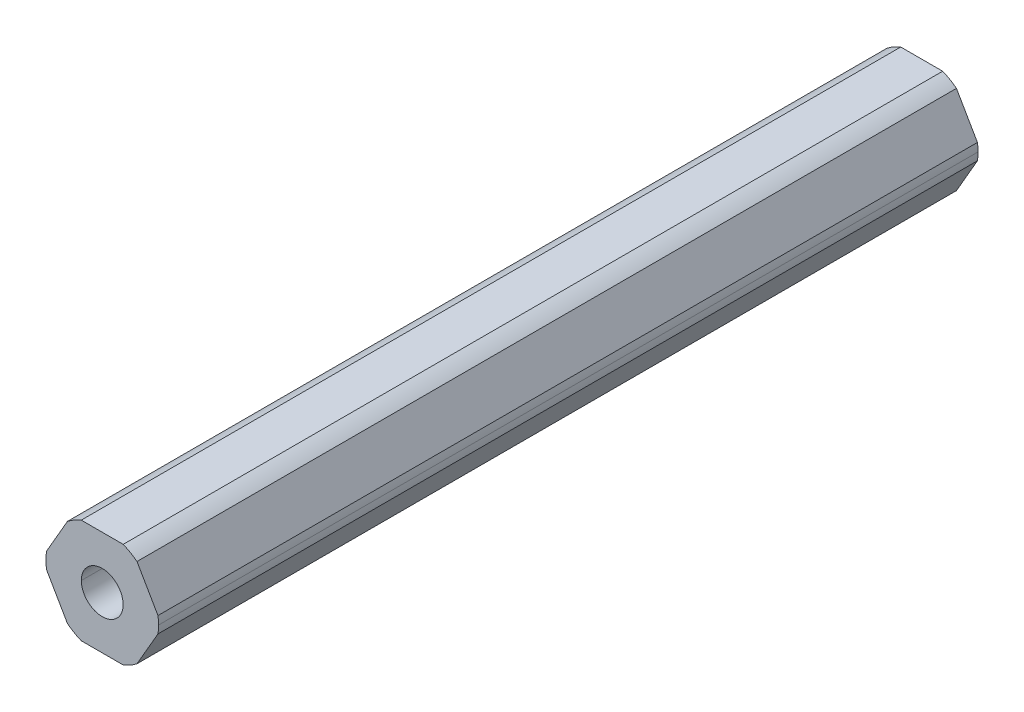
ISO-10303-21;
HEADER;
FILE_DESCRIPTION(('STEP AP214'),'2;1');
FILE_NAME('part.step','',(''),(''),'','','');
FILE_SCHEMA(('AUTOMOTIVE_DESIGN { 1 0 10303 214 1 1 1 1 }'));
ENDSEC;
DATA;
#1=APPLICATION_CONTEXT('core data for automotive mechanical design processes');
#2=APPLICATION_PROTOCOL_DEFINITION('international standard','automotive_design',2000,#1);
#3=PRODUCT_CONTEXT('',#1,'mechanical');
#4=PRODUCT('Part','Part','',(#3));
#5=PRODUCT_RELATED_PRODUCT_CATEGORY('part','',(#4));
#6=PRODUCT_DEFINITION_FORMATION('','',#4);
#7=PRODUCT_DEFINITION_CONTEXT('part definition',#1,'design');
#8=PRODUCT_DEFINITION('design','',#6,#7);
#9=PRODUCT_DEFINITION_SHAPE('','',#8);
#10=(LENGTH_UNIT() NAMED_UNIT(*) SI_UNIT(.MILLI.,.METRE.));
#11=(NAMED_UNIT(*) PLANE_ANGLE_UNIT() SI_UNIT($,.RADIAN.));
#12=(NAMED_UNIT(*) SI_UNIT($,.STERADIAN.) SOLID_ANGLE_UNIT());
#13=UNCERTAINTY_MEASURE_WITH_UNIT(LENGTH_MEASURE(1.E-05),#10,'distance_accuracy_value','');
#14=(GEOMETRIC_REPRESENTATION_CONTEXT(3) GLOBAL_UNCERTAINTY_ASSIGNED_CONTEXT((#13)) GLOBAL_UNIT_ASSIGNED_CONTEXT((#10,
#11,#12)) REPRESENTATION_CONTEXT('',''));
#15=CARTESIAN_POINT('',(0.,0.,0.));
#16=DIRECTION('',(0.,0.,1.));
#17=DIRECTION('',(1.,0.,0.));
#18=AXIS2_PLACEMENT_3D('',#15,#16,#17);
#19=CARTESIAN_POINT('',(0.,0.,-228.6));
#20=DIRECTION('',(0.,0.,1.));
#21=DIRECTION('',(1.,0.,0.));
#22=AXIS2_PLACEMENT_3D('',#19,#20,#21);
#23=CYLINDRICAL_SURFACE('',#22,2.55);
#24=CARTESIAN_POINT('',(0.,0.,-128.6));
#25=DIRECTION('',(0.,0.,1.));
#26=DIRECTION('',(1.,0.,0.));
#27=AXIS2_PLACEMENT_3D('',#24,#25,#26);
#28=CIRCLE('',#27,2.55);
#29=CARTESIAN_POINT('',(2.55,0.,-128.6));
#30=VERTEX_POINT('',#29);
#31=CARTESIAN_POINT('',(-2.55,0.,-128.6));
#32=VERTEX_POINT('',#31);
#33=EDGE_CURVE('E59',#30,#32,#28,.F.);
#34=ORIENTED_EDGE('',*,*,#33,.F.);
#35=DIRECTION('',(0.,0.,1.));
#36=VECTOR('',#35,1.);
#37=CARTESIAN_POINT('',(2.55,0.,-228.6));
#38=LINE('',#37,#36);
#39=CARTESIAN_POINT('',(2.55,0.,-228.6));
#40=VERTEX_POINT('',#39);
#41=EDGE_CURVE('E239',#40,#30,#38,.T.);
#42=ORIENTED_EDGE('',*,*,#41,.F.);
#43=CARTESIAN_POINT('',(0.,0.,-228.6));
#44=DIRECTION('',(0.,0.,1.));
#45=DIRECTION('',(1.,0.,0.));
#46=AXIS2_PLACEMENT_3D('',#43,#44,#45);
#47=CIRCLE('',#46,2.55);
#48=CARTESIAN_POINT('',(-2.55,0.,-228.6));
#49=VERTEX_POINT('',#48);
#50=EDGE_CURVE('E185',#49,#40,#47,.T.);
#51=ORIENTED_EDGE('',*,*,#50,.F.);
#52=DIRECTION('',(0.,0.,1.));
#53=VECTOR('',#52,1.);
#54=CARTESIAN_POINT('',(-2.55,0.,-228.6));
#55=LINE('',#54,#53);
#56=EDGE_CURVE('E46',#49,#32,#55,.T.);
#57=ORIENTED_EDGE('',*,*,#56,.T.);
#58=EDGE_LOOP('',(#34,#42,#51,#57));
#59=FACE_BOUND('',#58,.T.);
#60=ADVANCED_FACE('F38',(#59),#23,.F.);
#61=CARTESIAN_POINT('',(0.,0.,-228.6));
#62=DIRECTION('',(0.,0.,1.));
#63=DIRECTION('',(1.,0.,0.));
#64=AXIS2_PLACEMENT_3D('',#61,#62,#63);
#65=CYLINDRICAL_SURFACE('',#64,6.87);
#66=DIRECTION('',(0.,0.,1.));
#67=VECTOR('',#66,1.);
#68=CARTESIAN_POINT('',(6.87,0.,-228.6));
#69=LINE('',#68,#67);
#70=CARTESIAN_POINT('',(6.87,0.,-228.6));
#71=VERTEX_POINT('',#70);
#72=CARTESIAN_POINT('',(6.87,0.,-128.6));
#73=VERTEX_POINT('',#72);
#74=EDGE_CURVE('E237',#71,#73,#69,.T.);
#75=ORIENTED_EDGE('',*,*,#74,.T.);
#76=CARTESIAN_POINT('',(0.,0.,-128.6));
#77=DIRECTION('',(0.,0.,1.));
#78=DIRECTION('',(1.,0.,0.));
#79=AXIS2_PLACEMENT_3D('',#76,#77,#78);
#80=CIRCLE('',#79,6.87);
#81=CARTESIAN_POINT('',(6.80102150534208,-0.971085209378955,-128.6));
#82=VERTEX_POINT('',#81);
#83=EDGE_CURVE('E160',#82,#73,#80,.T.);
#84=ORIENTED_EDGE('',*,*,#83,.F.);
#85=DIRECTION('',(0.,0.,-1.));
#86=VECTOR('',#85,1.);
#87=CARTESIAN_POINT('',(6.80102150534208,-0.971085209378962,-228.6));
#88=LINE('',#87,#86);
#89=CARTESIAN_POINT('',(6.80102150534208,-0.971085209378955,-228.6));
#90=VERTEX_POINT('',#89);
#91=EDGE_CURVE('E235',#82,#90,#88,.T.);
#92=ORIENTED_EDGE('',*,*,#91,.T.);
#93=CARTESIAN_POINT('',(0.,0.,-228.6));
#94=DIRECTION('',(0.,0.,1.));
#95=DIRECTION('',(1.,0.,0.));
#96=AXIS2_PLACEMENT_3D('',#93,#94,#95);
#97=CIRCLE('',#96,6.87);
#98=EDGE_CURVE('E201',#90,#71,#97,.T.);
#99=ORIENTED_EDGE('',*,*,#98,.T.);
#100=EDGE_LOOP('',(#75,#84,#92,#99));
#101=FACE_BOUND('',#100,.T.);
#102=ADVANCED_FACE('F362',(#101),#65,.T.);
#103=CARTESIAN_POINT('',(3.68083890619154,-6.3754,228.6));
#104=DIRECTION('',(-0.866025403784439,0.5,0.));
#105=DIRECTION('',(0.,0.,1.));
#106=AXIS2_PLACEMENT_3D('',#103,#104,#105);
#107=PLANE('',#106);
#108=DIRECTION('',(0.500000000000001,0.866025403784438,0.));
#109=VECTOR('',#108,1.);
#110=CARTESIAN_POINT('',(4.24149521323254,-5.40431479062105,-128.6));
#111=LINE('',#110,#109);
#112=CARTESIAN_POINT('',(4.24149521323254,-5.40431479062105,-128.6));
#113=VERTEX_POINT('',#112);
#114=EDGE_CURVE('E305',#113,#82,#111,.T.);
#115=ORIENTED_EDGE('',*,*,#114,.F.);
#116=DIRECTION('',(0.,0.,1.));
#117=VECTOR('',#116,1.);
#118=CARTESIAN_POINT('',(4.24149521323255,-5.40431479062104,-228.6));
#119=LINE('',#118,#117);
#120=CARTESIAN_POINT('',(4.24149521323254,-5.40431479062105,-228.6));
#121=VERTEX_POINT('',#120);
#122=EDGE_CURVE('E179',#121,#113,#119,.T.);
#123=ORIENTED_EDGE('',*,*,#122,.F.);
#124=DIRECTION('',(0.5,0.866025403784439,0.));
#125=VECTOR('',#124,1.);
#126=CARTESIAN_POINT('',(3.68083890619154,-6.3754,-228.6));
#127=LINE('',#126,#125);
#128=EDGE_CURVE('E238',#121,#90,#127,.T.);
#129=ORIENTED_EDGE('',*,*,#128,.T.);
#130=ORIENTED_EDGE('',*,*,#91,.F.);
#131=EDGE_LOOP('',(#115,#123,#129,#130));
#132=FACE_BOUND('',#131,.T.);
#133=ADVANCED_FACE('F332',(#132),#107,.F.);
#134=CARTESIAN_POINT('',(7.36167781238308,0.,228.6));
#135=DIRECTION('',(-0.866025403784439,-0.5,0.));
#136=DIRECTION('',(-0.5,0.866025403784439,0.));
#137=AXIS2_PLACEMENT_3D('',#134,#135,#136);
#138=PLANE('',#137);
#139=DIRECTION('',(-0.5,0.866025403784438,0.));
#140=VECTOR('',#139,1.);
#141=CARTESIAN_POINT('',(6.80102150534208,0.97108520937895,-128.6));
#142=LINE('',#141,#140);
#143=CARTESIAN_POINT('',(6.80102150534208,0.97108520937895,-128.6));
#144=VERTEX_POINT('',#143);
#145=CARTESIAN_POINT('',(4.24149521323254,5.40431479062105,-128.6));
#146=VERTEX_POINT('',#145);
#147=EDGE_CURVE('E53',#144,#146,#142,.T.);
#148=ORIENTED_EDGE('',*,*,#147,.F.);
#149=DIRECTION('',(0.,0.,1.));
#150=VECTOR('',#149,1.);
#151=CARTESIAN_POINT('',(6.80102150534208,0.971085209378949,-228.6));
#152=LINE('',#151,#150);
#153=CARTESIAN_POINT('',(6.80102150534208,0.97108520937895,-228.6));
#154=VERTEX_POINT('',#153);
#155=EDGE_CURVE('E169',#154,#144,#152,.T.);
#156=ORIENTED_EDGE('',*,*,#155,.F.);
#157=DIRECTION('',(-0.5,0.866025403784439,0.));
#158=VECTOR('',#157,1.);
#159=CARTESIAN_POINT('',(7.36167781238308,0.,-228.6));
#160=LINE('',#159,#158);
#161=CARTESIAN_POINT('',(4.24149521323254,5.40431479062105,-228.6));
#162=VERTEX_POINT('',#161);
#163=EDGE_CURVE('E206',#154,#162,#160,.T.);
#164=ORIENTED_EDGE('',*,*,#163,.T.);
#165=DIRECTION('',(0.,0.,-1.));
#166=VECTOR('',#165,1.);
#167=CARTESIAN_POINT('',(4.24149521323254,5.40431479062105,-228.6));
#168=LINE('',#167,#166);
#169=EDGE_CURVE('E171',#146,#162,#168,.T.);
#170=ORIENTED_EDGE('',*,*,#169,.F.);
#171=EDGE_LOOP('',(#148,#156,#164,#170));
#172=FACE_BOUND('',#171,.T.);
#173=ADVANCED_FACE('F167',(#172),#138,.F.);
#174=CARTESIAN_POINT('',(3.68083890619154,6.3754,228.6));
#175=DIRECTION('',(0.,-1.,0.));
#176=DIRECTION('',(0.,0.,-1.));
#177=AXIS2_PLACEMENT_3D('',#174,#175,#176);
#178=PLANE('',#177);
#179=DIRECTION('',(-1.,0.,0.));
#180=VECTOR('',#179,1.);
#181=CARTESIAN_POINT('',(2.55952629210953,6.3754,-128.6));
#182=LINE('',#181,#180);
#183=CARTESIAN_POINT('',(2.55952629210953,6.3754,-128.6));
#184=VERTEX_POINT('',#183);
#185=CARTESIAN_POINT('',(-2.55952629210953,6.3754,-128.6));
#186=VERTEX_POINT('',#185);
#187=EDGE_CURVE('E319',#184,#186,#182,.T.);
#188=ORIENTED_EDGE('',*,*,#187,.F.);
#189=DIRECTION('',(0.,0.,1.));
#190=VECTOR('',#189,1.);
#191=CARTESIAN_POINT('',(2.55952629210952,6.3754,-228.6));
#192=LINE('',#191,#190);
#193=CARTESIAN_POINT('',(2.55952629210952,6.3754,-228.6));
#194=VERTEX_POINT('',#193);
#195=EDGE_CURVE('E243',#194,#184,#192,.T.);
#196=ORIENTED_EDGE('',*,*,#195,.F.);
#197=DIRECTION('',(-1.,0.,0.));
#198=VECTOR('',#197,1.);
#199=CARTESIAN_POINT('',(3.68083890619154,6.3754,-228.6));
#200=LINE('',#199,#198);
#201=CARTESIAN_POINT('',(-2.55952629210953,6.3754,-228.6));
#202=VERTEX_POINT('',#201);
#203=EDGE_CURVE('E202',#194,#202,#200,.T.);
#204=ORIENTED_EDGE('',*,*,#203,.T.);
#205=DIRECTION('',(0.,0.,-1.));
#206=VECTOR('',#205,1.);
#207=CARTESIAN_POINT('',(-2.55952629210953,6.3754,-228.6));
#208=LINE('',#207,#206);
#209=EDGE_CURVE('E230',#186,#202,#208,.T.);
#210=ORIENTED_EDGE('',*,*,#209,.F.);
#211=EDGE_LOOP('',(#188,#196,#204,#210));
#212=FACE_BOUND('',#211,.T.);
#213=ADVANCED_FACE('F323',(#212),#178,.F.);
#214=CARTESIAN_POINT('',(-3.68083890619154,6.3754,228.6));
#215=DIRECTION('',(0.866025403784439,-0.5,0.));
#216=DIRECTION('',(0.,0.,-1.));
#217=AXIS2_PLACEMENT_3D('',#214,#215,#216);
#218=PLANE('',#217);
#219=DIRECTION('',(-0.5,-0.866025403784438,0.));
#220=VECTOR('',#219,1.);
#221=CARTESIAN_POINT('',(-4.24149521323255,5.40431479062105,-128.6));
#222=LINE('',#221,#220);
#223=CARTESIAN_POINT('',(-4.24149521323254,5.40431479062105,-128.6));
#224=VERTEX_POINT('',#223);
#225=CARTESIAN_POINT('',(-6.80102150534208,0.97108520937896,-128.6));
#226=VERTEX_POINT('',#225);
#227=EDGE_CURVE('E290',#224,#226,#222,.T.);
#228=ORIENTED_EDGE('',*,*,#227,.F.);
#229=DIRECTION('',(0.,0.,1.));
#230=VECTOR('',#229,1.);
#231=CARTESIAN_POINT('',(-4.24149521323255,5.40431479062105,-228.6));
#232=LINE('',#231,#230);
#233=CARTESIAN_POINT('',(-4.24149521323255,5.40431479062105,-228.6));
#234=VERTEX_POINT('',#233);
#235=EDGE_CURVE('E257',#234,#224,#232,.T.);
#236=ORIENTED_EDGE('',*,*,#235,.F.);
#237=DIRECTION('',(-0.5,-0.866025403784439,0.));
#238=VECTOR('',#237,1.);
#239=CARTESIAN_POINT('',(-3.68083890619154,6.3754,-228.6));
#240=LINE('',#239,#238);
#241=CARTESIAN_POINT('',(-6.80102150534208,0.97108520937896,-228.6));
#242=VERTEX_POINT('',#241);
#243=EDGE_CURVE('E207',#234,#242,#240,.T.);
#244=ORIENTED_EDGE('',*,*,#243,.T.);
#245=DIRECTION('',(0.,0.,-1.));
#246=VECTOR('',#245,1.);
#247=CARTESIAN_POINT('',(-6.80102150534208,0.97108520937896,-228.6));
#248=LINE('',#247,#246);
#249=EDGE_CURVE('E208',#226,#242,#248,.T.);
#250=ORIENTED_EDGE('',*,*,#249,.F.);
#251=EDGE_LOOP('',(#228,#236,#244,#250));
#252=FACE_BOUND('',#251,.T.);
#253=ADVANCED_FACE('F287',(#252),#218,.F.);
#254=CARTESIAN_POINT('',(-7.36167781238308,0.,228.6));
#255=DIRECTION('',(0.866025403784439,0.5,0.));
#256=DIRECTION('',(0.,0.,-1.));
#257=AXIS2_PLACEMENT_3D('',#254,#255,#256);
#258=PLANE('',#257);
#259=DIRECTION('',(0.5,-0.866025403784439,0.));
#260=VECTOR('',#259,1.);
#261=CARTESIAN_POINT('',(-6.80102150534208,-0.971085209378954,-128.6));
#262=LINE('',#261,#260);
#263=CARTESIAN_POINT('',(-6.80102150534208,-0.971085209378951,-128.6));
#264=VERTEX_POINT('',#263);
#265=CARTESIAN_POINT('',(-4.24149521323254,-5.40431479062105,-128.6));
#266=VERTEX_POINT('',#265);
#267=EDGE_CURVE('E313',#264,#266,#262,.T.);
#268=ORIENTED_EDGE('',*,*,#267,.F.);
#269=DIRECTION('',(0.,0.,1.));
#270=VECTOR('',#269,1.);
#271=CARTESIAN_POINT('',(-6.80102150534208,-0.971085209378962,-228.6));
#272=LINE('',#271,#270);
#273=CARTESIAN_POINT('',(-6.80102150534208,-0.971085209378956,-228.6));
#274=VERTEX_POINT('',#273);
#275=EDGE_CURVE('E226',#274,#264,#272,.T.);
#276=ORIENTED_EDGE('',*,*,#275,.F.);
#277=DIRECTION('',(0.5,-0.866025403784439,0.));
#278=VECTOR('',#277,1.);
#279=CARTESIAN_POINT('',(-7.36167781238308,0.,-228.6));
#280=LINE('',#279,#278);
#281=CARTESIAN_POINT('',(-4.24149521323254,-5.40431479062105,-228.6));
#282=VERTEX_POINT('',#281);
#283=EDGE_CURVE('E221',#274,#282,#280,.T.);
#284=ORIENTED_EDGE('',*,*,#283,.T.);
#285=DIRECTION('',(0.,0.,-1.));
#286=VECTOR('',#285,1.);
#287=CARTESIAN_POINT('',(-4.24149521323255,-5.40431479062104,-228.6));
#288=LINE('',#287,#286);
#289=EDGE_CURVE('E216',#266,#282,#288,.T.);
#290=ORIENTED_EDGE('',*,*,#289,.F.);
#291=EDGE_LOOP('',(#268,#276,#284,#290));
#292=FACE_BOUND('',#291,.T.);
#293=ADVANCED_FACE('F346',(#292),#258,.F.);
#294=CARTESIAN_POINT('',(-3.68083890619154,-6.3754,228.6));
#295=DIRECTION('',(0.,1.,0.));
#296=DIRECTION('',(1.,0.,0.));
#297=AXIS2_PLACEMENT_3D('',#294,#295,#296);
#298=PLANE('',#297);
#299=DIRECTION('',(1.,0.,0.));
#300=VECTOR('',#299,1.);
#301=CARTESIAN_POINT('',(-2.55952629210953,-6.3754,-128.6));
#302=LINE('',#301,#300);
#303=CARTESIAN_POINT('',(-2.55952629210953,-6.3754,-128.6));
#304=VERTEX_POINT('',#303);
#305=CARTESIAN_POINT('',(2.55952629210953,-6.3754,-128.6));
#306=VERTEX_POINT('',#305);
#307=EDGE_CURVE('E309',#304,#306,#302,.T.);
#308=ORIENTED_EDGE('',*,*,#307,.F.);
#309=DIRECTION('',(0.,0.,1.));
#310=VECTOR('',#309,1.);
#311=CARTESIAN_POINT('',(-2.55952629210953,-6.3754,-228.6));
#312=LINE('',#311,#310);
#313=CARTESIAN_POINT('',(-2.55952629210953,-6.3754,-228.6));
#314=VERTEX_POINT('',#313);
#315=EDGE_CURVE('E209',#314,#304,#312,.T.);
#316=ORIENTED_EDGE('',*,*,#315,.F.);
#317=DIRECTION('',(1.,0.,0.));
#318=VECTOR('',#317,1.);
#319=CARTESIAN_POINT('',(-3.68083890619154,-6.3754,-228.6));
#320=LINE('',#319,#318);
#321=CARTESIAN_POINT('',(2.55952629210953,-6.3754,-228.6));
#322=VERTEX_POINT('',#321);
#323=EDGE_CURVE('E217',#314,#322,#320,.T.);
#324=ORIENTED_EDGE('',*,*,#323,.T.);
#325=DIRECTION('',(0.,0.,-1.));
#326=VECTOR('',#325,1.);
#327=CARTESIAN_POINT('',(2.55952629210953,-6.3754,-228.6));
#328=LINE('',#327,#326);
#329=EDGE_CURVE('E189',#306,#322,#328,.T.);
#330=ORIENTED_EDGE('',*,*,#329,.F.);
#331=EDGE_LOOP('',(#308,#316,#324,#330));
#332=FACE_BOUND('',#331,.T.);
#333=ADVANCED_FACE('F350',(#332),#298,.F.);
#334=CARTESIAN_POINT('',(0.,0.,-228.6));
#335=DIRECTION('',(0.,0.,1.));
#336=DIRECTION('',(1.,0.,0.));
#337=AXIS2_PLACEMENT_3D('',#334,#335,#336);
#338=CYLINDRICAL_SURFACE('',#337,6.87);
#339=ORIENTED_EDGE('',*,*,#155,.T.);
#340=EDGE_CURVE('E157',#73,#144,#80,.T.);
#341=ORIENTED_EDGE('',*,*,#340,.F.);
#342=ORIENTED_EDGE('',*,*,#74,.F.);
#343=CARTESIAN_POINT('',(0.,0.,-228.6));
#344=DIRECTION('',(0.,0.,1.));
#345=DIRECTION('',(1.,0.,0.));
#346=AXIS2_PLACEMENT_3D('',#343,#344,#345);
#347=CIRCLE('',#346,6.87);
#348=EDGE_CURVE('E177',#71,#154,#347,.T.);
#349=ORIENTED_EDGE('',*,*,#348,.T.);
#350=EDGE_LOOP('',(#339,#341,#342,#349));
#351=FACE_BOUND('',#350,.T.);
#352=ADVANCED_FACE('F175',(#351),#338,.T.);
#353=CARTESIAN_POINT('',(0.,0.,-228.6));
#354=DIRECTION('',(0.,0.,1.));
#355=DIRECTION('',(1.,0.,0.));
#356=AXIS2_PLACEMENT_3D('',#353,#354,#355);
#357=CYLINDRICAL_SURFACE('',#356,6.87);
#358=ORIENTED_EDGE('',*,*,#122,.T.);
#359=CARTESIAN_POINT('',(0.,0.,-128.6));
#360=DIRECTION('',(0.,0.,1.));
#361=DIRECTION('',(1.,0.,0.));
#362=AXIS2_PLACEMENT_3D('',#359,#360,#361);
#363=CIRCLE('',#362,6.87);
#364=EDGE_CURVE('E307',#306,#113,#363,.T.);
#365=ORIENTED_EDGE('',*,*,#364,.F.);
#366=ORIENTED_EDGE('',*,*,#329,.T.);
#367=CARTESIAN_POINT('',(0.,0.,-228.6));
#368=DIRECTION('',(0.,0.,1.));
#369=DIRECTION('',(1.,0.,0.));
#370=AXIS2_PLACEMENT_3D('',#367,#368,#369);
#371=CIRCLE('',#370,6.87);
#372=EDGE_CURVE('E193',#322,#121,#371,.T.);
#373=ORIENTED_EDGE('',*,*,#372,.T.);
#374=EDGE_LOOP('',(#358,#365,#366,#373));
#375=FACE_BOUND('',#374,.T.);
#376=ADVANCED_FACE('F335',(#375),#357,.T.);
#377=CARTESIAN_POINT('',(0.,0.,-228.6));
#378=DIRECTION('',(0.,0.,1.));
#379=DIRECTION('',(1.,0.,0.));
#380=AXIS2_PLACEMENT_3D('',#377,#378,#379);
#381=CYLINDRICAL_SURFACE('',#380,6.87);
#382=ORIENTED_EDGE('',*,*,#315,.T.);
#383=CARTESIAN_POINT('',(0.,0.,-128.6));
#384=DIRECTION('',(0.,0.,1.));
#385=DIRECTION('',(1.,0.,0.));
#386=AXIS2_PLACEMENT_3D('',#383,#384,#385);
#387=CIRCLE('',#386,6.87);
#388=EDGE_CURVE('E311',#266,#304,#387,.T.);
#389=ORIENTED_EDGE('',*,*,#388,.F.);
#390=ORIENTED_EDGE('',*,*,#289,.T.);
#391=CARTESIAN_POINT('',(0.,0.,-228.6));
#392=DIRECTION('',(0.,0.,1.));
#393=DIRECTION('',(1.,0.,0.));
#394=AXIS2_PLACEMENT_3D('',#391,#392,#393);
#395=CIRCLE('',#394,6.87);
#396=EDGE_CURVE('E212',#282,#314,#395,.T.);
#397=ORIENTED_EDGE('',*,*,#396,.T.);
#398=EDGE_LOOP('',(#382,#389,#390,#397));
#399=FACE_BOUND('',#398,.T.);
#400=ADVANCED_FACE('F341',(#399),#381,.T.);
#401=CARTESIAN_POINT('',(0.,0.,-228.6));
#402=DIRECTION('',(0.,0.,1.));
#403=DIRECTION('',(1.,0.,0.));
#404=AXIS2_PLACEMENT_3D('',#401,#402,#403);
#405=CYLINDRICAL_SURFACE('',#404,6.87);
#406=ORIENTED_EDGE('',*,*,#275,.T.);
#407=CARTESIAN_POINT('',(0.,0.,-128.6));
#408=DIRECTION('',(0.,0.,1.));
#409=DIRECTION('',(1.,0.,0.));
#410=AXIS2_PLACEMENT_3D('',#407,#408,#409);
#411=CIRCLE('',#410,6.87);
#412=EDGE_CURVE('E315',#226,#264,#411,.T.);
#413=ORIENTED_EDGE('',*,*,#412,.F.);
#414=ORIENTED_EDGE('',*,*,#249,.T.);
#415=CARTESIAN_POINT('',(0.,0.,-228.6));
#416=DIRECTION('',(0.,0.,1.));
#417=DIRECTION('',(1.,0.,0.));
#418=AXIS2_PLACEMENT_3D('',#415,#416,#417);
#419=CIRCLE('',#418,6.87);
#420=EDGE_CURVE('E210',#242,#274,#419,.T.);
#421=ORIENTED_EDGE('',*,*,#420,.T.);
#422=EDGE_LOOP('',(#406,#413,#414,#421));
#423=FACE_BOUND('',#422,.T.);
#424=ADVANCED_FACE('F348',(#423),#405,.T.);
#425=CARTESIAN_POINT('',(0.,0.,-228.6));
#426=DIRECTION('',(0.,0.,1.));
#427=DIRECTION('',(1.,0.,0.));
#428=AXIS2_PLACEMENT_3D('',#425,#426,#427);
#429=CYLINDRICAL_SURFACE('',#428,6.87);
#430=ORIENTED_EDGE('',*,*,#235,.T.);
#431=CARTESIAN_POINT('',(0.,0.,-128.6));
#432=DIRECTION('',(0.,0.,1.));
#433=DIRECTION('',(1.,0.,0.));
#434=AXIS2_PLACEMENT_3D('',#431,#432,#433);
#435=CIRCLE('',#434,6.87);
#436=EDGE_CURVE('E281',#186,#224,#435,.T.);
#437=ORIENTED_EDGE('',*,*,#436,.F.);
#438=ORIENTED_EDGE('',*,*,#209,.T.);
#439=CARTESIAN_POINT('',(0.,0.,-228.6));
#440=DIRECTION('',(0.,0.,1.));
#441=DIRECTION('',(1.,0.,0.));
#442=AXIS2_PLACEMENT_3D('',#439,#440,#441);
#443=CIRCLE('',#442,6.87);
#444=EDGE_CURVE('E253',#202,#234,#443,.T.);
#445=ORIENTED_EDGE('',*,*,#444,.T.);
#446=EDGE_LOOP('',(#430,#437,#438,#445));
#447=FACE_BOUND('',#446,.T.);
#448=ADVANCED_FACE('F280',(#447),#429,.T.);
#449=CARTESIAN_POINT('',(0.,0.,-228.6));
#450=DIRECTION('',(0.,0.,1.));
#451=DIRECTION('',(1.,0.,0.));
#452=AXIS2_PLACEMENT_3D('',#449,#450,#451);
#453=CYLINDRICAL_SURFACE('',#452,6.87);
#454=ORIENTED_EDGE('',*,*,#195,.T.);
#455=CARTESIAN_POINT('',(0.,0.,-128.6));
#456=DIRECTION('',(0.,0.,1.));
#457=DIRECTION('',(1.,0.,0.));
#458=AXIS2_PLACEMENT_3D('',#455,#456,#457);
#459=CIRCLE('',#458,6.87);
#460=EDGE_CURVE('E172',#146,#184,#459,.T.);
#461=ORIENTED_EDGE('',*,*,#460,.F.);
#462=ORIENTED_EDGE('',*,*,#169,.T.);
#463=CARTESIAN_POINT('',(0.,0.,-228.6));
#464=DIRECTION('',(0.,0.,1.));
#465=DIRECTION('',(1.,0.,0.));
#466=AXIS2_PLACEMENT_3D('',#463,#464,#465);
#467=CIRCLE('',#466,6.87);
#468=EDGE_CURVE('E259',#162,#194,#467,.T.);
#469=ORIENTED_EDGE('',*,*,#468,.T.);
#470=EDGE_LOOP('',(#454,#461,#462,#469));
#471=FACE_BOUND('',#470,.T.);
#472=ADVANCED_FACE('F374',(#471),#453,.T.);
#473=CARTESIAN_POINT('',(0.,0.,-228.6));
#474=DIRECTION('',(0.,0.,1.));
#475=DIRECTION('',(1.,0.,0.));
#476=AXIS2_PLACEMENT_3D('',#473,#474,#475);
#477=CYLINDRICAL_SURFACE('',#476,2.55);
#478=CARTESIAN_POINT('',(0.,0.,-128.6));
#479=DIRECTION('',(0.,0.,1.));
#480=DIRECTION('',(1.,0.,0.));
#481=AXIS2_PLACEMENT_3D('',#478,#479,#480);
#482=CIRCLE('',#481,2.55);
#483=EDGE_CURVE('E11',#32,#30,#482,.F.);
#484=ORIENTED_EDGE('',*,*,#483,.F.);
#485=ORIENTED_EDGE('',*,*,#56,.F.);
#486=CARTESIAN_POINT('',(0.,0.,-228.6));
#487=DIRECTION('',(0.,0.,1.));
#488=DIRECTION('',(1.,0.,0.));
#489=AXIS2_PLACEMENT_3D('',#486,#487,#488);
#490=CIRCLE('',#489,2.55);
#491=EDGE_CURVE('E197',#40,#49,#490,.T.);
#492=ORIENTED_EDGE('',*,*,#491,.F.);
#493=ORIENTED_EDGE('',*,*,#41,.T.);
#494=EDGE_LOOP('',(#484,#485,#492,#493));
#495=FACE_BOUND('',#494,.T.);
#496=ADVANCED_FACE('F375',(#495),#477,.F.);
#497=CARTESIAN_POINT('',(0.,0.,-228.6));
#498=DIRECTION('',(0.,0.,1.));
#499=DIRECTION('',(1.,0.,0.));
#500=AXIS2_PLACEMENT_3D('',#497,#498,#499);
#501=PLANE('',#500);
#502=ORIENTED_EDGE('',*,*,#468,.F.);
#503=ORIENTED_EDGE('',*,*,#163,.F.);
#504=ORIENTED_EDGE('',*,*,#348,.F.);
#505=ORIENTED_EDGE('',*,*,#98,.F.);
#506=ORIENTED_EDGE('',*,*,#128,.F.);
#507=ORIENTED_EDGE('',*,*,#372,.F.);
#508=ORIENTED_EDGE('',*,*,#323,.F.);
#509=ORIENTED_EDGE('',*,*,#396,.F.);
#510=ORIENTED_EDGE('',*,*,#283,.F.);
#511=ORIENTED_EDGE('',*,*,#420,.F.);
#512=ORIENTED_EDGE('',*,*,#243,.F.);
#513=ORIENTED_EDGE('',*,*,#444,.F.);
#514=ORIENTED_EDGE('',*,*,#203,.F.);
#515=EDGE_LOOP('',(#502,#503,#504,#505,#506,#507,#508,#509,#510,#511,#512,#513,#514));
#516=FACE_BOUND('',#515,.T.);
#517=ORIENTED_EDGE('',*,*,#491,.T.);
#518=ORIENTED_EDGE('',*,*,#50,.T.);
#519=EDGE_LOOP('',(#517,#518));
#520=FACE_BOUND('',#519,.T.);
#521=ADVANCED_FACE('F40',(#516,#520),#501,.F.);
#522=CARTESIAN_POINT('',(0.,0.,-128.6));
#523=DIRECTION('',(0.,0.,1.));
#524=DIRECTION('',(1.,0.,0.));
#525=AXIS2_PLACEMENT_3D('',#522,#523,#524);
#526=PLANE('',#525);
#527=ORIENTED_EDGE('',*,*,#83,.T.);
#528=ORIENTED_EDGE('',*,*,#340,.T.);
#529=ORIENTED_EDGE('',*,*,#147,.T.);
#530=ORIENTED_EDGE('',*,*,#460,.T.);
#531=ORIENTED_EDGE('',*,*,#187,.T.);
#532=ORIENTED_EDGE('',*,*,#436,.T.);
#533=ORIENTED_EDGE('',*,*,#227,.T.);
#534=ORIENTED_EDGE('',*,*,#412,.T.);
#535=ORIENTED_EDGE('',*,*,#267,.T.);
#536=ORIENTED_EDGE('',*,*,#388,.T.);
#537=ORIENTED_EDGE('',*,*,#307,.T.);
#538=ORIENTED_EDGE('',*,*,#364,.T.);
#539=ORIENTED_EDGE('',*,*,#114,.T.);
#540=EDGE_LOOP('',(#527,#528,#529,#530,#531,#532,#533,#534,#535,#536,#537,#538,#539));
#541=FACE_BOUND('',#540,.T.);
#542=ORIENTED_EDGE('',*,*,#33,.T.);
#543=ORIENTED_EDGE('',*,*,#483,.T.);
#544=EDGE_LOOP('',(#542,#543));
#545=FACE_BOUND('',#544,.T.);
#546=ADVANCED_FACE('F158',(#541,#545),#526,.T.);
#547=CLOSED_SHELL('',(#60,#102,#133,#173,#213,#253,#293,#333,#352,#376,#400,#424,#448,#472,#496,
#521,#546));
#548=MANIFOLD_SOLID_BREP('B2',#547);
#549=ADVANCED_BREP_SHAPE_REPRESENTATION('',(#18,#548),#14);
#550=SHAPE_DEFINITION_REPRESENTATION(#9,#549);
ENDSEC;
END-ISO-10303-21;
